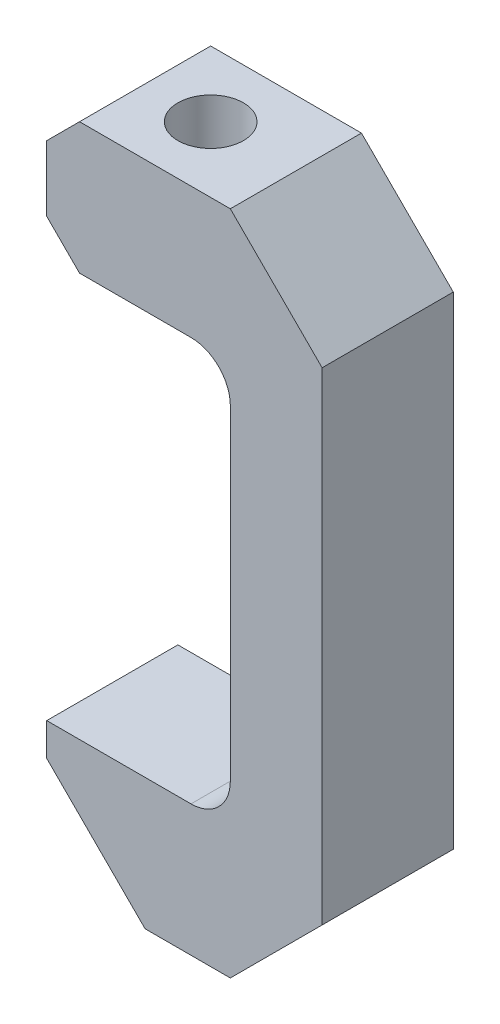
ISO-10303-21;
HEADER;
FILE_DESCRIPTION(('STEP AP214'),'2;1');
FILE_NAME('part.step','',(''),(''),'','','');
FILE_SCHEMA(('AUTOMOTIVE_DESIGN { 1 0 10303 214 1 1 1 1 }'));
ENDSEC;
DATA;
#1=APPLICATION_CONTEXT('core data for automotive mechanical design processes');
#2=APPLICATION_PROTOCOL_DEFINITION('international standard','automotive_design',2000,#1);
#3=PRODUCT_CONTEXT('',#1,'mechanical');
#4=PRODUCT('Part','Part','',(#3));
#5=PRODUCT_RELATED_PRODUCT_CATEGORY('part','',(#4));
#6=PRODUCT_DEFINITION_FORMATION('','',#4);
#7=PRODUCT_DEFINITION_CONTEXT('part definition',#1,'design');
#8=PRODUCT_DEFINITION('design','',#6,#7);
#9=PRODUCT_DEFINITION_SHAPE('','',#8);
#10=(LENGTH_UNIT() NAMED_UNIT(*) SI_UNIT(.MILLI.,.METRE.));
#11=(NAMED_UNIT(*) PLANE_ANGLE_UNIT() SI_UNIT($,.RADIAN.));
#12=(NAMED_UNIT(*) SI_UNIT($,.STERADIAN.) SOLID_ANGLE_UNIT());
#13=UNCERTAINTY_MEASURE_WITH_UNIT(LENGTH_MEASURE(1.E-05),#10,'distance_accuracy_value','');
#14=(GEOMETRIC_REPRESENTATION_CONTEXT(3) GLOBAL_UNCERTAINTY_ASSIGNED_CONTEXT((#13)) GLOBAL_UNIT_ASSIGNED_CONTEXT((#10,
#11,#12)) REPRESENTATION_CONTEXT('',''));
#15=CARTESIAN_POINT('',(0.,0.,0.));
#16=DIRECTION('',(0.,0.,1.));
#17=DIRECTION('',(1.,0.,0.));
#18=AXIS2_PLACEMENT_3D('',#15,#16,#17);
#19=CARTESIAN_POINT('',(15.3,15.3,20.));
#20=DIRECTION('',(-0.707106781186548,-0.707106781186548,0.));
#21=DIRECTION('',(0.707106781186548,-0.707106781186548,0.));
#22=AXIS2_PLACEMENT_3D('',#19,#20,#21);
#23=PLANE('',#22);
#24=DIRECTION('',(-0.707106781186548,0.707106781186548,0.));
#25=VECTOR('',#24,1.);
#26=CARTESIAN_POINT('',(15.3,15.3,0.));
#27=LINE('',#26,#25);
#28=CARTESIAN_POINT('',(-37.,67.6,0.));
#29=VERTEX_POINT('',#28);
#30=CARTESIAN_POINT('',(-42.,72.6,0.));
#31=VERTEX_POINT('',#30);
#32=EDGE_CURVE('E146',#29,#31,#27,.T.);
#33=ORIENTED_EDGE('',*,*,#32,.F.);
#34=DIRECTION('',(0.,0.,-1.));
#35=VECTOR('',#34,1.);
#36=CARTESIAN_POINT('',(-37.,67.6,20.));
#37=LINE('',#36,#35);
#38=CARTESIAN_POINT('',(-37.,67.6,20.));
#39=VERTEX_POINT('',#38);
#40=EDGE_CURVE('E142',#39,#29,#37,.T.);
#41=ORIENTED_EDGE('',*,*,#40,.F.);
#42=DIRECTION('',(-0.707106781186548,0.707106781186548,0.));
#43=VECTOR('',#42,1.);
#44=CARTESIAN_POINT('',(15.3,15.3,20.));
#45=LINE('',#44,#43);
#46=CARTESIAN_POINT('',(-42.,72.6,20.));
#47=VERTEX_POINT('',#46);
#48=EDGE_CURVE('E144',#39,#47,#45,.T.);
#49=ORIENTED_EDGE('',*,*,#48,.T.);
#50=DIRECTION('',(0.,0.,-1.));
#51=VECTOR('',#50,1.);
#52=CARTESIAN_POINT('',(-42.,72.6,20.));
#53=LINE('',#52,#51);
#54=EDGE_CURVE('E191',#47,#31,#53,.T.);
#55=ORIENTED_EDGE('',*,*,#54,.T.);
#56=EDGE_LOOP('',(#33,#41,#49,#55));
#57=FACE_BOUND('',#56,.T.);
#58=ADVANCED_FACE('F35',(#57),#23,.T.);
#59=CARTESIAN_POINT('',(0.,67.6,20.));
#60=DIRECTION('',(0.,1.,0.));
#61=DIRECTION('',(0.,0.,1.));
#62=AXIS2_PLACEMENT_3D('',#59,#60,#61);
#63=PLANE('',#62);
#64=CARTESIAN_POINT('',(-27.,67.6,9.99999999999999));
#65=DIRECTION('',(0.,1.,0.));
#66=DIRECTION('',(0.,0.,1.));
#67=AXIS2_PLACEMENT_3D('',#64,#65,#66);
#68=CIRCLE('',#67,5.);
#69=CARTESIAN_POINT('',(-32.,67.6,9.99999999999999));
#70=VERTEX_POINT('',#69);
#71=EDGE_CURVE('E166',#70,#70,#68,.T.);
#72=ORIENTED_EDGE('',*,*,#71,.T.);
#73=EDGE_LOOP('',(#72));
#74=FACE_BOUND('',#73,.T.);
#75=DIRECTION('',(1.,0.,0.));
#76=VECTOR('',#75,1.);
#77=CARTESIAN_POINT('',(0.,67.6,0.));
#78=LINE('',#77,#76);
#79=CARTESIAN_POINT('',(-20.,67.6,0.));
#80=VERTEX_POINT('',#79);
#81=EDGE_CURVE('E193',#29,#80,#78,.T.);
#82=ORIENTED_EDGE('',*,*,#81,.T.);
#83=DIRECTION('',(0.,0.,-1.));
#84=VECTOR('',#83,1.);
#85=CARTESIAN_POINT('',(-20.,67.6,20.));
#86=LINE('',#85,#84);
#87=CARTESIAN_POINT('',(-20.,67.6,20.));
#88=VERTEX_POINT('',#87);
#89=EDGE_CURVE('E50',#80,#88,#86,.F.);
#90=ORIENTED_EDGE('',*,*,#89,.T.);
#91=DIRECTION('',(1.,0.,0.));
#92=VECTOR('',#91,1.);
#93=CARTESIAN_POINT('',(0.,67.6,20.));
#94=LINE('',#93,#92);
#95=EDGE_CURVE('E150',#39,#88,#94,.T.);
#96=ORIENTED_EDGE('',*,*,#95,.F.);
#97=ORIENTED_EDGE('',*,*,#40,.T.);
#98=EDGE_LOOP('',(#82,#90,#96,#97));
#99=FACE_BOUND('',#98,.T.);
#100=ADVANCED_FACE('F151',(#74,#99),#63,.F.);
#101=CARTESIAN_POINT('',(-14.,0.,20.));
#102=DIRECTION('',(1.,0.,0.));
#103=DIRECTION('',(0.,1.,0.));
#104=AXIS2_PLACEMENT_3D('',#101,#102,#103);
#105=PLANE('',#104);
#106=DIRECTION('',(0.,-1.,0.));
#107=VECTOR('',#106,1.);
#108=CARTESIAN_POINT('',(-14.,0.,0.));
#109=LINE('',#108,#107);
#110=CARTESIAN_POINT('',(-14.,61.6,0.));
#111=VERTEX_POINT('',#110);
#112=CARTESIAN_POINT('',(-14.,12.,0.));
#113=VERTEX_POINT('',#112);
#114=EDGE_CURVE('E195',#111,#113,#109,.T.);
#115=ORIENTED_EDGE('',*,*,#114,.T.);
#116=DIRECTION('',(0.,0.,-1.));
#117=VECTOR('',#116,1.);
#118=CARTESIAN_POINT('',(-14.,12.,20.));
#119=LINE('',#118,#117);
#120=CARTESIAN_POINT('',(-14.,12.,20.));
#121=VERTEX_POINT('',#120);
#122=EDGE_CURVE('E247',#113,#121,#119,.F.);
#123=ORIENTED_EDGE('',*,*,#122,.T.);
#124=DIRECTION('',(0.,-1.,0.));
#125=VECTOR('',#124,1.);
#126=CARTESIAN_POINT('',(-14.,0.,20.));
#127=LINE('',#126,#125);
#128=CARTESIAN_POINT('',(-14.,61.6,20.));
#129=VERTEX_POINT('',#128);
#130=EDGE_CURVE('E154',#129,#121,#127,.T.);
#131=ORIENTED_EDGE('',*,*,#130,.F.);
#132=DIRECTION('',(0.,0.,-1.));
#133=VECTOR('',#132,1.);
#134=CARTESIAN_POINT('',(-14.,61.6,0.));
#135=LINE('',#134,#133);
#136=EDGE_CURVE('E244',#129,#111,#135,.T.);
#137=ORIENTED_EDGE('',*,*,#136,.T.);
#138=EDGE_LOOP('',(#115,#123,#131,#137));
#139=FACE_BOUND('',#138,.T.);
#140=ADVANCED_FACE('F267',(#139),#105,.F.);
#141=CARTESIAN_POINT('',(0.,6.,20.));
#142=DIRECTION('',(0.,1.,0.));
#143=DIRECTION('',(0.,0.,1.));
#144=AXIS2_PLACEMENT_3D('',#141,#142,#143);
#145=PLANE('',#144);
#146=DIRECTION('',(1.,0.,0.));
#147=VECTOR('',#146,1.);
#148=CARTESIAN_POINT('',(0.,6.,20.));
#149=LINE('',#148,#147);
#150=CARTESIAN_POINT('',(-42.,6.,20.));
#151=VERTEX_POINT('',#150);
#152=CARTESIAN_POINT('',(-20.,6.,20.));
#153=VERTEX_POINT('',#152);
#154=EDGE_CURVE('E171',#151,#153,#149,.T.);
#155=ORIENTED_EDGE('',*,*,#154,.T.);
#156=DIRECTION('',(0.,0.,-1.));
#157=VECTOR('',#156,1.);
#158=CARTESIAN_POINT('',(-20.,6.,20.));
#159=LINE('',#158,#157);
#160=CARTESIAN_POINT('',(-20.,6.,0.));
#161=VERTEX_POINT('',#160);
#162=EDGE_CURVE('E147',#153,#161,#159,.T.);
#163=ORIENTED_EDGE('',*,*,#162,.T.);
#164=DIRECTION('',(1.,0.,0.));
#165=VECTOR('',#164,1.);
#166=CARTESIAN_POINT('',(0.,6.,0.));
#167=LINE('',#166,#165);
#168=CARTESIAN_POINT('',(-42.,6.,0.));
#169=VERTEX_POINT('',#168);
#170=EDGE_CURVE('E198',#169,#161,#167,.T.);
#171=ORIENTED_EDGE('',*,*,#170,.F.);
#172=DIRECTION('',(0.,0.,-1.));
#173=VECTOR('',#172,1.);
#174=CARTESIAN_POINT('',(-42.,6.,20.));
#175=LINE('',#174,#173);
#176=EDGE_CURVE('E148',#151,#169,#175,.T.);
#177=ORIENTED_EDGE('',*,*,#176,.F.);
#178=EDGE_LOOP('',(#155,#163,#171,#177));
#179=FACE_BOUND('',#178,.T.);
#180=ADVANCED_FACE('F260',(#179),#145,.T.);
#181=CARTESIAN_POINT('',(-42.,0.,20.));
#182=DIRECTION('',(1.,0.,0.));
#183=DIRECTION('',(0.,0.,-1.));
#184=AXIS2_PLACEMENT_3D('',#181,#182,#183);
#185=PLANE('',#184);
#186=DIRECTION('',(0.,-1.,0.));
#187=VECTOR('',#186,1.);
#188=CARTESIAN_POINT('',(-42.,0.,0.));
#189=LINE('',#188,#187);
#190=CARTESIAN_POINT('',(-42.,1.,0.));
#191=VERTEX_POINT('',#190);
#192=EDGE_CURVE('E201',#169,#191,#189,.T.);
#193=ORIENTED_EDGE('',*,*,#192,.T.);
#194=DIRECTION('',(0.,0.,-1.));
#195=VECTOR('',#194,1.);
#196=CARTESIAN_POINT('',(-42.,1.,20.));
#197=LINE('',#196,#195);
#198=CARTESIAN_POINT('',(-42.,1.,20.));
#199=VERTEX_POINT('',#198);
#200=EDGE_CURVE('E238',#199,#191,#197,.T.);
#201=ORIENTED_EDGE('',*,*,#200,.F.);
#202=DIRECTION('',(0.,-1.,0.));
#203=VECTOR('',#202,1.);
#204=CARTESIAN_POINT('',(-42.,0.,20.));
#205=LINE('',#204,#203);
#206=EDGE_CURVE('E174',#151,#199,#205,.T.);
#207=ORIENTED_EDGE('',*,*,#206,.F.);
#208=ORIENTED_EDGE('',*,*,#176,.T.);
#209=EDGE_LOOP('',(#193,#201,#207,#208));
#210=FACE_BOUND('',#209,.T.);
#211=ADVANCED_FACE('F287',(#210),#185,.F.);
#212=CARTESIAN_POINT('',(-20.5,-20.5,20.));
#213=DIRECTION('',(0.707106781186547,0.707106781186548,0.));
#214=DIRECTION('',(-0.707106781186548,0.707106781186547,0.));
#215=AXIS2_PLACEMENT_3D('',#212,#213,#214);
#216=PLANE('',#215);
#217=DIRECTION('',(0.707106781186548,-0.707106781186547,0.));
#218=VECTOR('',#217,1.);
#219=CARTESIAN_POINT('',(-20.5,-20.5,0.));
#220=LINE('',#219,#218);
#221=CARTESIAN_POINT('',(-27.,-14.,0.));
#222=VERTEX_POINT('',#221);
#223=EDGE_CURVE('E203',#191,#222,#220,.T.);
#224=ORIENTED_EDGE('',*,*,#223,.T.);
#225=DIRECTION('',(0.,0.,-1.));
#226=VECTOR('',#225,1.);
#227=CARTESIAN_POINT('',(-27.,-14.,20.));
#228=LINE('',#227,#226);
#229=CARTESIAN_POINT('',(-27.,-14.,20.));
#230=VERTEX_POINT('',#229);
#231=EDGE_CURVE('E235',#230,#222,#228,.T.);
#232=ORIENTED_EDGE('',*,*,#231,.F.);
#233=DIRECTION('',(0.707106781186548,-0.707106781186547,0.));
#234=VECTOR('',#233,1.);
#235=CARTESIAN_POINT('',(-20.5,-20.5,20.));
#236=LINE('',#235,#234);
#237=EDGE_CURVE('E176',#199,#230,#236,.T.);
#238=ORIENTED_EDGE('',*,*,#237,.F.);
#239=ORIENTED_EDGE('',*,*,#200,.T.);
#240=EDGE_LOOP('',(#224,#232,#238,#239));
#241=FACE_BOUND('',#240,.T.);
#242=ADVANCED_FACE('F290',(#241),#216,.F.);
#243=CARTESIAN_POINT('',(0.,-14.,20.));
#244=DIRECTION('',(0.,1.,0.));
#245=DIRECTION('',(-1.,0.,0.));
#246=AXIS2_PLACEMENT_3D('',#243,#244,#245);
#247=PLANE('',#246);
#248=DIRECTION('',(1.,0.,0.));
#249=VECTOR('',#248,1.);
#250=CARTESIAN_POINT('',(0.,-14.,0.));
#251=LINE('',#250,#249);
#252=CARTESIAN_POINT('',(-14.,-14.,0.));
#253=VERTEX_POINT('',#252);
#254=EDGE_CURVE('E205',#222,#253,#251,.T.);
#255=ORIENTED_EDGE('',*,*,#254,.T.);
#256=DIRECTION('',(0.,0.,-1.));
#257=VECTOR('',#256,1.);
#258=CARTESIAN_POINT('',(-14.,-14.,20.));
#259=LINE('',#258,#257);
#260=CARTESIAN_POINT('',(-14.,-14.,20.));
#261=VERTEX_POINT('',#260);
#262=EDGE_CURVE('E232',#261,#253,#259,.T.);
#263=ORIENTED_EDGE('',*,*,#262,.F.);
#264=DIRECTION('',(1.,0.,0.));
#265=VECTOR('',#264,1.);
#266=CARTESIAN_POINT('',(0.,-14.,20.));
#267=LINE('',#266,#265);
#268=EDGE_CURVE('E178',#230,#261,#267,.T.);
#269=ORIENTED_EDGE('',*,*,#268,.F.);
#270=ORIENTED_EDGE('',*,*,#231,.T.);
#271=EDGE_LOOP('',(#255,#263,#269,#270));
#272=FACE_BOUND('',#271,.T.);
#273=ADVANCED_FACE('F294',(#272),#247,.F.);
#274=CARTESIAN_POINT('',(0.,0.,20.));
#275=DIRECTION('',(-0.707106781186548,0.707106781186548,0.));
#276=DIRECTION('',(-0.707106781186548,-0.707106781186548,0.));
#277=AXIS2_PLACEMENT_3D('',#274,#275,#276);
#278=PLANE('',#277);
#279=DIRECTION('',(0.707106781186548,0.707106781186548,0.));
#280=VECTOR('',#279,1.);
#281=CARTESIAN_POINT('',(0.,0.,0.));
#282=LINE('',#281,#280);
#283=CARTESIAN_POINT('',(0.,0.,0.));
#284=VERTEX_POINT('',#283);
#285=EDGE_CURVE('E207',#253,#284,#282,.T.);
#286=ORIENTED_EDGE('',*,*,#285,.T.);
#287=DIRECTION('',(0.,0.,-1.));
#288=VECTOR('',#287,1.);
#289=CARTESIAN_POINT('',(0.,0.,20.));
#290=LINE('',#289,#288);
#291=CARTESIAN_POINT('',(0.,0.,20.));
#292=VERTEX_POINT('',#291);
#293=EDGE_CURVE('E229',#292,#284,#290,.T.);
#294=ORIENTED_EDGE('',*,*,#293,.F.);
#295=DIRECTION('',(0.707106781186548,0.707106781186548,0.));
#296=VECTOR('',#295,1.);
#297=CARTESIAN_POINT('',(0.,0.,20.));
#298=LINE('',#297,#296);
#299=EDGE_CURVE('E180',#261,#292,#298,.T.);
#300=ORIENTED_EDGE('',*,*,#299,.F.);
#301=ORIENTED_EDGE('',*,*,#262,.T.);
#302=EDGE_LOOP('',(#286,#294,#300,#301));
#303=FACE_BOUND('',#302,.T.);
#304=ADVANCED_FACE('F298',(#303),#278,.F.);
#305=CARTESIAN_POINT('',(0.,0.,20.));
#306=DIRECTION('',(-1.,0.,0.));
#307=DIRECTION('',(0.,-1.,0.));
#308=AXIS2_PLACEMENT_3D('',#305,#306,#307);
#309=PLANE('',#308);
#310=DIRECTION('',(0.,1.,0.));
#311=VECTOR('',#310,1.);
#312=CARTESIAN_POINT('',(0.,0.,0.));
#313=LINE('',#312,#311);
#314=CARTESIAN_POINT('',(0.,73.6,0.));
#315=VERTEX_POINT('',#314);
#316=EDGE_CURVE('E209',#284,#315,#313,.T.);
#317=ORIENTED_EDGE('',*,*,#316,.T.);
#318=DIRECTION('',(0.,0.,-1.));
#319=VECTOR('',#318,1.);
#320=CARTESIAN_POINT('',(0.,73.6,20.));
#321=LINE('',#320,#319);
#322=CARTESIAN_POINT('',(0.,73.6,20.));
#323=VERTEX_POINT('',#322);
#324=EDGE_CURVE('E226',#323,#315,#321,.T.);
#325=ORIENTED_EDGE('',*,*,#324,.F.);
#326=DIRECTION('',(0.,1.,0.));
#327=VECTOR('',#326,1.);
#328=CARTESIAN_POINT('',(0.,0.,20.));
#329=LINE('',#328,#327);
#330=EDGE_CURVE('E182',#292,#323,#329,.T.);
#331=ORIENTED_EDGE('',*,*,#330,.F.);
#332=ORIENTED_EDGE('',*,*,#293,.T.);
#333=EDGE_LOOP('',(#317,#325,#331,#332));
#334=FACE_BOUND('',#333,.T.);
#335=ADVANCED_FACE('F302',(#334),#309,.F.);
#336=CARTESIAN_POINT('',(36.8,36.8,20.));
#337=DIRECTION('',(-0.707106781186547,-0.707106781186548,0.));
#338=DIRECTION('',(0.707106781186548,-0.707106781186547,0.));
#339=AXIS2_PLACEMENT_3D('',#336,#337,#338);
#340=PLANE('',#339);
#341=DIRECTION('',(-0.707106781186548,0.707106781186547,0.));
#342=VECTOR('',#341,1.);
#343=CARTESIAN_POINT('',(36.8,36.8,0.));
#344=LINE('',#343,#342);
#345=CARTESIAN_POINT('',(-14.,87.6,0.));
#346=VERTEX_POINT('',#345);
#347=EDGE_CURVE('E211',#315,#346,#344,.T.);
#348=ORIENTED_EDGE('',*,*,#347,.T.);
#349=DIRECTION('',(0.,0.,-1.));
#350=VECTOR('',#349,1.);
#351=CARTESIAN_POINT('',(-14.,87.6,20.));
#352=LINE('',#351,#350);
#353=CARTESIAN_POINT('',(-14.,87.6,20.));
#354=VERTEX_POINT('',#353);
#355=EDGE_CURVE('E223',#354,#346,#352,.T.);
#356=ORIENTED_EDGE('',*,*,#355,.F.);
#357=DIRECTION('',(-0.707106781186548,0.707106781186547,0.));
#358=VECTOR('',#357,1.);
#359=CARTESIAN_POINT('',(36.8,36.8,20.));
#360=LINE('',#359,#358);
#361=EDGE_CURVE('E184',#323,#354,#360,.T.);
#362=ORIENTED_EDGE('',*,*,#361,.F.);
#363=ORIENTED_EDGE('',*,*,#324,.T.);
#364=EDGE_LOOP('',(#348,#356,#362,#363));
#365=FACE_BOUND('',#364,.T.);
#366=ADVANCED_FACE('F306',(#365),#340,.F.);
#367=CARTESIAN_POINT('',(-1.11022302462516E-13,87.6,20.));
#368=DIRECTION('',(0.,-1.,0.));
#369=DIRECTION('',(1.,0.,0.));
#370=AXIS2_PLACEMENT_3D('',#367,#368,#369);
#371=PLANE('',#370);
#372=CARTESIAN_POINT('',(-27.,87.6,9.99999999999999));
#373=DIRECTION('',(0.,1.,0.));
#374=DIRECTION('',(-1.,0.,0.));
#375=AXIS2_PLACEMENT_3D('',#372,#373,#374);
#376=CIRCLE('',#375,5.);
#377=CARTESIAN_POINT('',(-32.,87.6,9.99999999999999));
#378=VERTEX_POINT('',#377);
#379=EDGE_CURVE('E334',#378,#378,#376,.T.);
#380=ORIENTED_EDGE('',*,*,#379,.F.);
#381=EDGE_LOOP('',(#380));
#382=FACE_BOUND('',#381,.T.);
#383=DIRECTION('',(-1.,0.,0.));
#384=VECTOR('',#383,1.);
#385=CARTESIAN_POINT('',(-1.11022302462516E-13,87.6,0.));
#386=LINE('',#385,#384);
#387=CARTESIAN_POINT('',(-37.,87.6,0.));
#388=VERTEX_POINT('',#387);
#389=EDGE_CURVE('E213',#346,#388,#386,.T.);
#390=ORIENTED_EDGE('',*,*,#389,.T.);
#391=DIRECTION('',(0.,0.,-1.));
#392=VECTOR('',#391,1.);
#393=CARTESIAN_POINT('',(-37.,87.6,20.));
#394=LINE('',#393,#392);
#395=CARTESIAN_POINT('',(-37.,87.6,20.));
#396=VERTEX_POINT('',#395);
#397=EDGE_CURVE('E220',#396,#388,#394,.T.);
#398=ORIENTED_EDGE('',*,*,#397,.F.);
#399=DIRECTION('',(-1.,0.,0.));
#400=VECTOR('',#399,1.);
#401=CARTESIAN_POINT('',(-1.11022302462516E-13,87.6,20.));
#402=LINE('',#401,#400);
#403=EDGE_CURVE('E186',#354,#396,#402,.T.);
#404=ORIENTED_EDGE('',*,*,#403,.F.);
#405=ORIENTED_EDGE('',*,*,#355,.T.);
#406=EDGE_LOOP('',(#390,#398,#404,#405));
#407=FACE_BOUND('',#406,.T.);
#408=ADVANCED_FACE('F310',(#382,#407),#371,.F.);
#409=CARTESIAN_POINT('',(-62.2999999999999,62.3000000000002,20.));
#410=DIRECTION('',(0.707106781186546,-0.707106781186549,0.));
#411=DIRECTION('',(0.707106781186549,0.707106781186546,0.));
#412=AXIS2_PLACEMENT_3D('',#409,#410,#411);
#413=PLANE('',#412);
#414=DIRECTION('',(-0.707106781186549,-0.707106781186546,0.));
#415=VECTOR('',#414,1.);
#416=CARTESIAN_POINT('',(-62.2999999999999,62.3000000000002,0.));
#417=LINE('',#416,#415);
#418=CARTESIAN_POINT('',(-42.,82.6,0.));
#419=VERTEX_POINT('',#418);
#420=EDGE_CURVE('E163',#388,#419,#417,.T.);
#421=ORIENTED_EDGE('',*,*,#420,.T.);
#422=DIRECTION('',(0.,0.,-1.));
#423=VECTOR('',#422,1.);
#424=CARTESIAN_POINT('',(-42.,82.6,20.));
#425=LINE('',#424,#423);
#426=CARTESIAN_POINT('',(-42.,82.6,20.));
#427=VERTEX_POINT('',#426);
#428=EDGE_CURVE('E217',#427,#419,#425,.T.);
#429=ORIENTED_EDGE('',*,*,#428,.F.);
#430=DIRECTION('',(-0.707106781186549,-0.707106781186546,0.));
#431=VECTOR('',#430,1.);
#432=CARTESIAN_POINT('',(-62.2999999999999,62.3000000000002,20.));
#433=LINE('',#432,#431);
#434=EDGE_CURVE('E188',#396,#427,#433,.T.);
#435=ORIENTED_EDGE('',*,*,#434,.F.);
#436=ORIENTED_EDGE('',*,*,#397,.T.);
#437=EDGE_LOOP('',(#421,#429,#435,#436));
#438=FACE_BOUND('',#437,.T.);
#439=ADVANCED_FACE('F314',(#438),#413,.F.);
#440=CARTESIAN_POINT('',(-42.0000000000001,0.,20.));
#441=DIRECTION('',(1.,0.,0.));
#442=DIRECTION('',(0.,1.,0.));
#443=AXIS2_PLACEMENT_3D('',#440,#441,#442);
#444=PLANE('',#443);
#445=DIRECTION('',(0.,-1.,0.));
#446=VECTOR('',#445,1.);
#447=CARTESIAN_POINT('',(-42.0000000000001,0.,0.));
#448=LINE('',#447,#446);
#449=EDGE_CURVE('E160',#419,#31,#448,.T.);
#450=ORIENTED_EDGE('',*,*,#449,.T.);
#451=ORIENTED_EDGE('',*,*,#54,.F.);
#452=DIRECTION('',(0.,-1.,0.));
#453=VECTOR('',#452,1.);
#454=CARTESIAN_POINT('',(-42.0000000000001,0.,20.));
#455=LINE('',#454,#453);
#456=EDGE_CURVE('E158',#427,#47,#455,.T.);
#457=ORIENTED_EDGE('',*,*,#456,.F.);
#458=ORIENTED_EDGE('',*,*,#428,.T.);
#459=EDGE_LOOP('',(#450,#451,#457,#458));
#460=FACE_BOUND('',#459,.T.);
#461=ADVANCED_FACE('F318',(#460),#444,.F.);
#462=CARTESIAN_POINT('',(0.,0.,20.));
#463=DIRECTION('',(0.,0.,1.));
#464=DIRECTION('',(1.,0.,0.));
#465=AXIS2_PLACEMENT_3D('',#462,#463,#464);
#466=PLANE('',#465);
#467=ORIENTED_EDGE('',*,*,#48,.F.);
#468=ORIENTED_EDGE('',*,*,#95,.T.);
#469=CARTESIAN_POINT('',(-20.,61.6,20.));
#470=DIRECTION('',(0.,0.,1.));
#471=DIRECTION('',(1.,0.,0.));
#472=AXIS2_PLACEMENT_3D('',#469,#470,#471);
#473=CIRCLE('',#472,6.);
#474=EDGE_CURVE('E11',#88,#129,#473,.F.);
#475=ORIENTED_EDGE('',*,*,#474,.T.);
#476=ORIENTED_EDGE('',*,*,#130,.T.);
#477=CARTESIAN_POINT('',(-20.,12.,20.));
#478=DIRECTION('',(0.,0.,1.));
#479=DIRECTION('',(1.,0.,0.));
#480=AXIS2_PLACEMENT_3D('',#477,#478,#479);
#481=CIRCLE('',#480,6.);
#482=EDGE_CURVE('E252',#121,#153,#481,.F.);
#483=ORIENTED_EDGE('',*,*,#482,.T.);
#484=ORIENTED_EDGE('',*,*,#154,.F.);
#485=ORIENTED_EDGE('',*,*,#206,.T.);
#486=ORIENTED_EDGE('',*,*,#237,.T.);
#487=ORIENTED_EDGE('',*,*,#268,.T.);
#488=ORIENTED_EDGE('',*,*,#299,.T.);
#489=ORIENTED_EDGE('',*,*,#330,.T.);
#490=ORIENTED_EDGE('',*,*,#361,.T.);
#491=ORIENTED_EDGE('',*,*,#403,.T.);
#492=ORIENTED_EDGE('',*,*,#434,.T.);
#493=ORIENTED_EDGE('',*,*,#456,.T.);
#494=EDGE_LOOP('',(#467,#468,#475,#476,#483,#484,#485,#486,#487,#488,#489,#490,#491,#492,#493));
#495=FACE_BOUND('',#494,.T.);
#496=ADVANCED_FACE('F156',(#495),#466,.T.);
#497=CARTESIAN_POINT('',(0.,0.,0.));
#498=DIRECTION('',(0.,0.,1.));
#499=DIRECTION('',(1.,0.,0.));
#500=AXIS2_PLACEMENT_3D('',#497,#498,#499);
#501=PLANE('',#500);
#502=ORIENTED_EDGE('',*,*,#32,.T.);
#503=ORIENTED_EDGE('',*,*,#449,.F.);
#504=ORIENTED_EDGE('',*,*,#420,.F.);
#505=ORIENTED_EDGE('',*,*,#389,.F.);
#506=ORIENTED_EDGE('',*,*,#347,.F.);
#507=ORIENTED_EDGE('',*,*,#316,.F.);
#508=ORIENTED_EDGE('',*,*,#285,.F.);
#509=ORIENTED_EDGE('',*,*,#254,.F.);
#510=ORIENTED_EDGE('',*,*,#223,.F.);
#511=ORIENTED_EDGE('',*,*,#192,.F.);
#512=ORIENTED_EDGE('',*,*,#170,.T.);
#513=CARTESIAN_POINT('',(-20.,12.,0.));
#514=DIRECTION('',(0.,0.,1.));
#515=DIRECTION('',(1.,0.,0.));
#516=AXIS2_PLACEMENT_3D('',#513,#514,#515);
#517=CIRCLE('',#516,6.);
#518=EDGE_CURVE('E250',#161,#113,#517,.T.);
#519=ORIENTED_EDGE('',*,*,#518,.T.);
#520=ORIENTED_EDGE('',*,*,#114,.F.);
#521=CARTESIAN_POINT('',(-20.,61.6,0.));
#522=DIRECTION('',(0.,0.,1.));
#523=DIRECTION('',(1.,0.,0.));
#524=AXIS2_PLACEMENT_3D('',#521,#522,#523);
#525=CIRCLE('',#524,6.);
#526=EDGE_CURVE('E43',#111,#80,#525,.T.);
#527=ORIENTED_EDGE('',*,*,#526,.T.);
#528=ORIENTED_EDGE('',*,*,#81,.F.);
#529=EDGE_LOOP('',(#502,#503,#504,#505,#506,#507,#508,#509,#510,#511,#512,#519,#520,#527,#528));
#530=FACE_BOUND('',#529,.T.);
#531=ADVANCED_FACE('F264',(#530),#501,.F.);
#532=CARTESIAN_POINT('',(-26.9999999999999,35.6,9.99999999999999));
#533=DIRECTION('',(0.,1.,0.));
#534=DIRECTION('',(-1.,0.,0.));
#535=AXIS2_PLACEMENT_3D('',#532,#533,#534);
#536=CYLINDRICAL_SURFACE('',#535,5.);
#537=CARTESIAN_POINT('',(-32.,87.6,9.99999999999999));
#538=CARTESIAN_POINT('',(-32.,87.3916666666667,9.99999999999999));
#539=CARTESIAN_POINT('',(-32.,87.1833333333333,9.99999999999999));
#540=CARTESIAN_POINT('',(-32.,86.7666666666667,9.99999999999999));
#541=CARTESIAN_POINT('',(-32.,86.5583333333333,9.99999999999999));
#542=CARTESIAN_POINT('',(-32.,86.1416666666666,9.99999999999999));
#543=CARTESIAN_POINT('',(-32.,85.9333333333333,9.99999999999999));
#544=CARTESIAN_POINT('',(-32.,85.5166666666666,9.99999999999999));
#545=CARTESIAN_POINT('',(-32.,85.3083333333333,9.99999999999999));
#546=CARTESIAN_POINT('',(-32.,84.8916666666666,9.99999999999999));
#547=CARTESIAN_POINT('',(-32.,84.6833333333333,9.99999999999999));
#548=CARTESIAN_POINT('',(-32.,84.2666666666666,9.99999999999999));
#549=CARTESIAN_POINT('',(-32.,84.0583333333333,9.99999999999999));
#550=CARTESIAN_POINT('',(-32.,83.6416666666666,9.99999999999999));
#551=CARTESIAN_POINT('',(-32.,83.4333333333333,9.99999999999999));
#552=CARTESIAN_POINT('',(-32.,83.0166666666666,9.99999999999999));
#553=CARTESIAN_POINT('',(-32.,82.8083333333333,9.99999999999999));
#554=CARTESIAN_POINT('',(-32.,82.3916666666666,9.99999999999999));
#555=CARTESIAN_POINT('',(-32.,82.1833333333333,9.99999999999999));
#556=CARTESIAN_POINT('',(-32.,81.7666666666666,9.99999999999999));
#557=CARTESIAN_POINT('',(-32.,81.5583333333333,9.99999999999999));
#558=CARTESIAN_POINT('',(-32.,81.1416666666666,9.99999999999999));
#559=CARTESIAN_POINT('',(-32.,80.9333333333333,9.99999999999999));
#560=CARTESIAN_POINT('',(-32.,80.5166666666666,9.99999999999999));
#561=CARTESIAN_POINT('',(-32.,80.3083333333333,9.99999999999999));
#562=CARTESIAN_POINT('',(-32.,79.8916666666667,9.99999999999999));
#563=CARTESIAN_POINT('',(-32.,79.6833333333333,9.99999999999999));
#564=CARTESIAN_POINT('',(-32.,79.2666666666667,9.99999999999999));
#565=CARTESIAN_POINT('',(-32.,79.0583333333333,9.99999999999999));
#566=CARTESIAN_POINT('',(-32.,78.6416666666667,9.99999999999999));
#567=CARTESIAN_POINT('',(-32.,78.4333333333333,9.99999999999999));
#568=CARTESIAN_POINT('',(-32.,78.0166666666667,9.99999999999999));
#569=CARTESIAN_POINT('',(-32.,77.8083333333333,9.99999999999999));
#570=CARTESIAN_POINT('',(-32.,77.3916666666667,9.99999999999999));
#571=CARTESIAN_POINT('',(-32.,77.1833333333333,9.99999999999999));
#572=CARTESIAN_POINT('',(-32.,76.7666666666667,9.99999999999999));
#573=CARTESIAN_POINT('',(-32.,76.5583333333333,9.99999999999999));
#574=CARTESIAN_POINT('',(-32.,76.1416666666667,9.99999999999999));
#575=CARTESIAN_POINT('',(-32.,75.9333333333333,9.99999999999999));
#576=CARTESIAN_POINT('',(-32.,75.5166666666667,9.99999999999999));
#577=CARTESIAN_POINT('',(-32.,75.3083333333333,9.99999999999999));
#578=CARTESIAN_POINT('',(-32.,74.8916666666667,9.99999999999999));
#579=CARTESIAN_POINT('',(-32.,74.6833333333333,9.99999999999999));
#580=CARTESIAN_POINT('',(-32.,74.2666666666667,9.99999999999999));
#581=CARTESIAN_POINT('',(-32.,74.0583333333333,9.99999999999999));
#582=CARTESIAN_POINT('',(-32.,73.6416666666667,9.99999999999999));
#583=CARTESIAN_POINT('',(-32.,73.4333333333333,9.99999999999999));
#584=CARTESIAN_POINT('',(-32.,73.0166666666667,9.99999999999999));
#585=CARTESIAN_POINT('',(-32.,72.8083333333333,9.99999999999999));
#586=CARTESIAN_POINT('',(-32.,72.3916666666667,9.99999999999999));
#587=CARTESIAN_POINT('',(-32.,72.1833333333333,9.99999999999999));
#588=CARTESIAN_POINT('',(-32.,71.7666666666667,9.99999999999999));
#589=CARTESIAN_POINT('',(-32.,71.5583333333333,9.99999999999999));
#590=CARTESIAN_POINT('',(-32.,71.1416666666667,9.99999999999999));
#591=CARTESIAN_POINT('',(-32.,70.9333333333333,9.99999999999999));
#592=CARTESIAN_POINT('',(-32.,70.5166666666667,9.99999999999999));
#593=CARTESIAN_POINT('',(-32.,70.3083333333333,9.99999999999999));
#594=CARTESIAN_POINT('',(-32.,69.8916666666667,9.99999999999999));
#595=CARTESIAN_POINT('',(-32.,69.6833333333333,9.99999999999999));
#596=CARTESIAN_POINT('',(-32.,69.2666666666667,9.99999999999999));
#597=CARTESIAN_POINT('',(-32.,69.0583333333333,9.99999999999999));
#598=CARTESIAN_POINT('',(-32.,68.6416666666667,9.99999999999999));
#599=CARTESIAN_POINT('',(-32.,68.4333333333333,9.99999999999999));
#600=CARTESIAN_POINT('',(-32.,68.0166666666667,9.99999999999999));
#601=CARTESIAN_POINT('',(-32.,67.8083333333333,9.99999999999999));
#602=CARTESIAN_POINT('',(-32.,67.6,9.99999999999999));
#603=B_SPLINE_CURVE_WITH_KNOTS('',3,(#537,#538,#539,#540,#541,#542,#543,#544,#545,#546,#547,
#548,#549,#550,#551,#552,#553,#554,#555,#556,#557,#558,#559,#560,#561,#562,#563,#564,#565,#566,
#567,#568,#569,#570,#571,#572,#573,#574,#575,#576,#577,#578,#579,#580,#581,#582,#583,#584,#585,
#586,#587,#588,#589,#590,#591,#592,#593,#594,#595,#596,#597,#598,#599,#600,#601,#602),
.UNSPECIFIED.,.F.,.F.,(4,2,2,2,2,2,2,2,2,2,2,2,2,2,2,2,2,2,2,2,2,2,2,2,2,2,2,2,2,2,2,2,4),(0.,
0.625000000000014,1.25,1.87500000000002,2.5,3.125,3.75,4.375,5.,5.62500000000001,
6.25000000000001,6.87500000000001,7.50000000000001,8.12499999999999,8.75000000000001,
9.37499999999999,10.,10.625,11.25,11.875,12.5,13.125,13.75,14.375,15.,15.625,16.25,16.875,17.5,
18.125,18.75,19.375,20.),.UNSPECIFIED.);
#604=EDGE_CURVE('BSEAM274',#378,#70,#603,.T.);
#605=ORIENTED_EDGE('',*,*,#379,.T.);
#606=ORIENTED_EDGE('',*,*,#71,.F.);
#607=ORIENTED_EDGE('',*,*,#604,.T.);
#608=ORIENTED_EDGE('',*,*,#604,.F.);
#609=EDGE_LOOP('',(#605,#607,#606,#608));
#610=FACE_BOUND('',#609,.T.);
#611=ADVANCED_FACE('F274',(#610),#536,.F.);
#612=CARTESIAN_POINT('',(-20.,12.,20.));
#613=DIRECTION('',(0.,0.,-1.));
#614=DIRECTION('',(-1.,0.,0.));
#615=AXIS2_PLACEMENT_3D('',#612,#613,#614);
#616=CYLINDRICAL_SURFACE('',#615,6.);
#617=ORIENTED_EDGE('',*,*,#482,.F.);
#618=ORIENTED_EDGE('',*,*,#122,.F.);
#619=ORIENTED_EDGE('',*,*,#518,.F.);
#620=ORIENTED_EDGE('',*,*,#162,.F.);
#621=EDGE_LOOP('',(#617,#618,#619,#620));
#622=FACE_BOUND('',#621,.T.);
#623=ADVANCED_FACE('F263',(#622),#616,.F.);
#624=CARTESIAN_POINT('',(-20.,61.6,20.));
#625=DIRECTION('',(0.,0.,1.));
#626=DIRECTION('',(1.,0.,0.));
#627=AXIS2_PLACEMENT_3D('',#624,#625,#626);
#628=CYLINDRICAL_SURFACE('',#627,6.);
#629=ORIENTED_EDGE('',*,*,#474,.F.);
#630=ORIENTED_EDGE('',*,*,#89,.F.);
#631=ORIENTED_EDGE('',*,*,#526,.F.);
#632=ORIENTED_EDGE('',*,*,#136,.F.);
#633=EDGE_LOOP('',(#629,#630,#631,#632));
#634=FACE_BOUND('',#633,.T.);
#635=ADVANCED_FACE('F37',(#634),#628,.F.);
#636=CLOSED_SHELL('',(#58,#100,#140,#180,#211,#242,#273,#304,#335,#366,#408,#439,#461,#496,#531,
#611,#623,#635));
#637=MANIFOLD_SOLID_BREP('B2',#636);
#638=ADVANCED_BREP_SHAPE_REPRESENTATION('',(#18,#637),#14);
#639=SHAPE_DEFINITION_REPRESENTATION(#9,#638);
ENDSEC;
END-ISO-10303-21;
